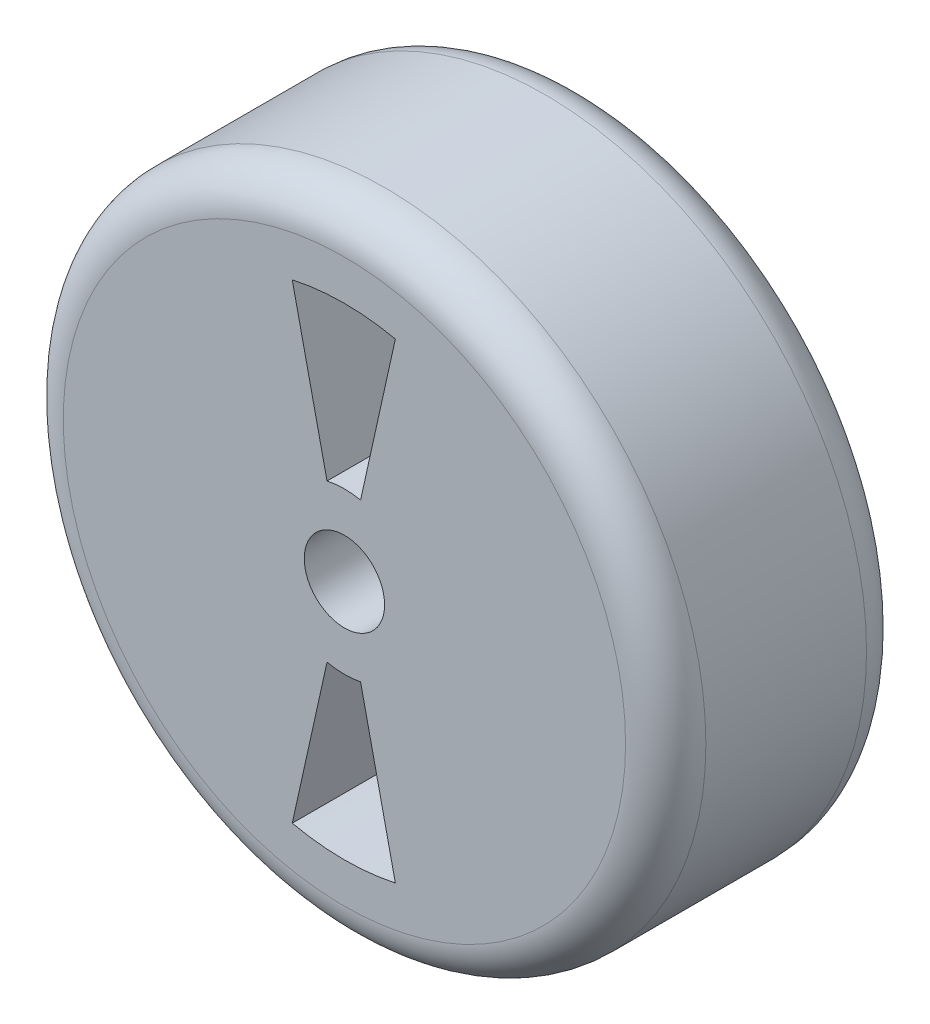
ISO-10303-21;
HEADER;
FILE_DESCRIPTION(('STEP AP214'),'2;1');
FILE_NAME('part.step','',(''),(''),'','','');
FILE_SCHEMA(('AUTOMOTIVE_DESIGN { 1 0 10303 214 1 1 1 1 }'));
ENDSEC;
DATA;
#1=APPLICATION_CONTEXT('core data for automotive mechanical design processes');
#2=APPLICATION_PROTOCOL_DEFINITION('international standard','automotive_design',2000,#1);
#3=PRODUCT_CONTEXT('',#1,'mechanical');
#4=PRODUCT('Part','Part','',(#3));
#5=PRODUCT_RELATED_PRODUCT_CATEGORY('part','',(#4));
#6=PRODUCT_DEFINITION_FORMATION('','',#4);
#7=PRODUCT_DEFINITION_CONTEXT('part definition',#1,'design');
#8=PRODUCT_DEFINITION('design','',#6,#7);
#9=PRODUCT_DEFINITION_SHAPE('','',#8);
#10=(LENGTH_UNIT() NAMED_UNIT(*) SI_UNIT(.MILLI.,.METRE.));
#11=(NAMED_UNIT(*) PLANE_ANGLE_UNIT() SI_UNIT($,.RADIAN.));
#12=(NAMED_UNIT(*) SI_UNIT($,.STERADIAN.) SOLID_ANGLE_UNIT());
#13=UNCERTAINTY_MEASURE_WITH_UNIT(LENGTH_MEASURE(1.E-05),#10,'distance_accuracy_value','');
#14=(GEOMETRIC_REPRESENTATION_CONTEXT(3) GLOBAL_UNCERTAINTY_ASSIGNED_CONTEXT((#13)) GLOBAL_UNIT_ASSIGNED_CONTEXT((#10,
#11,#12)) REPRESENTATION_CONTEXT('',''));
#15=CARTESIAN_POINT('',(0.,0.,0.));
#16=DIRECTION('',(0.,0.,1.));
#17=DIRECTION('',(1.,0.,0.));
#18=AXIS2_PLACEMENT_3D('',#15,#16,#17);
#19=CARTESIAN_POINT('',(0.,0.,-38.1));
#20=DIRECTION('',(0.,0.,1.));
#21=DIRECTION('',(1.,0.,0.));
#22=AXIS2_PLACEMENT_3D('',#19,#20,#21);
#23=PLANE('',#22);
#24=CARTESIAN_POINT('',(0.,0.,-38.1));
#25=DIRECTION('',(0.,0.,1.));
#26=DIRECTION('',(1.,0.,0.));
#27=AXIS2_PLACEMENT_3D('',#24,#25,#26);
#28=CIRCLE('',#27,12.7);
#29=CARTESIAN_POINT('',(12.7,0.,-38.1));
#30=VERTEX_POINT('',#29);
#31=EDGE_CURVE('E168',#30,#30,#28,.T.);
#32=ORIENTED_EDGE('',*,*,#31,.T.);
#33=EDGE_LOOP('',(#32));
#34=FACE_BOUND('',#33,.T.);
#35=CARTESIAN_POINT('',(0.,0.,-38.1));
#36=DIRECTION('',(0.,0.,1.));
#37=DIRECTION('',(1.,0.,0.));
#38=AXIS2_PLACEMENT_3D('',#35,#36,#37);
#39=CIRCLE('',#38,88.9);
#40=CARTESIAN_POINT('',(88.9,0.,-38.1));
#41=VERTEX_POINT('',#40);
#42=EDGE_CURVE('E11',#41,#41,#39,.F.);
#43=ORIENTED_EDGE('',*,*,#42,.T.);
#44=EDGE_LOOP('',(#43));
#45=FACE_BOUND('',#44,.T.);
#46=DIRECTION('',(0.216439613938104,-0.976296007119933,0.));
#47=VECTOR('',#46,1.);
#48=CARTESIAN_POINT('',(-5.49756619402784,24.7979185808463,-38.1));
#49=LINE('',#48,#47);
#50=CARTESIAN_POINT('',(-16.4944906129159,74.4018390712533,-38.1));
#51=VERTEX_POINT('',#50);
#52=CARTESIAN_POINT('',(-5.49756619402784,24.7979185808463,-38.1));
#53=VERTEX_POINT('',#52);
#54=EDGE_CURVE('E146',#51,#53,#49,.T.);
#55=ORIENTED_EDGE('',*,*,#54,.T.);
#56=CARTESIAN_POINT('',(0.,0.,-38.1));
#57=DIRECTION('',(0.,0.,-1.));
#58=DIRECTION('',(1.,0.,0.));
#59=AXIS2_PLACEMENT_3D('',#56,#57,#58);
#60=CIRCLE('',#59,25.4);
#61=CARTESIAN_POINT('',(5.11059947871828,24.8805500937605,-38.1));
#62=VERTEX_POINT('',#61);
#63=EDGE_CURVE('E136',#53,#62,#60,.T.);
#64=ORIENTED_EDGE('',*,*,#63,.T.);
#65=DIRECTION('',(0.216439613938103,0.976296007119933,0.));
#66=VECTOR('',#65,1.);
#67=CARTESIAN_POINT('',(5.11059947871828,24.8805500937605,-38.1));
#68=LINE('',#67,#66);
#69=CARTESIAN_POINT('',(16.1079686609387,74.486476781913,-38.1));
#70=VERTEX_POINT('',#69);
#71=EDGE_CURVE('E139',#62,#70,#68,.T.);
#72=ORIENTED_EDGE('',*,*,#71,.T.);
#73=CARTESIAN_POINT('',(0.,0.,-38.1));
#74=DIRECTION('',(0.,0.,1.));
#75=DIRECTION('',(1.,0.,0.));
#76=AXIS2_PLACEMENT_3D('',#73,#74,#75);
#77=CIRCLE('',#76,76.2082795880097);
#78=EDGE_CURVE('E143',#70,#51,#77,.T.);
#79=ORIENTED_EDGE('',*,*,#78,.T.);
#80=EDGE_LOOP('',(#55,#64,#72,#79));
#81=FACE_BOUND('',#80,.T.);
#82=CARTESIAN_POINT('',(0.,0.,-38.1));
#83=DIRECTION('',(0.,0.,1.));
#84=DIRECTION('',(1.,0.,0.));
#85=AXIS2_PLACEMENT_3D('',#82,#83,#84);
#86=CIRCLE('',#85,25.4);
#87=CARTESIAN_POINT('',(-5.49756619402784,-24.7979185808463,-38.1));
#88=VERTEX_POINT('',#87);
#89=CARTESIAN_POINT('',(5.11059947871828,-24.8805500937605,-38.1));
#90=VERTEX_POINT('',#89);
#91=EDGE_CURVE('E110',#88,#90,#86,.T.);
#92=ORIENTED_EDGE('',*,*,#91,.F.);
#93=DIRECTION('',(0.216439613938104,0.976296007119933,0.));
#94=VECTOR('',#93,1.);
#95=CARTESIAN_POINT('',(-5.49756619402784,-24.7979185808463,-38.1));
#96=LINE('',#95,#94);
#97=CARTESIAN_POINT('',(-16.4944906129159,-74.4018390712534,-38.1));
#98=VERTEX_POINT('',#97);
#99=EDGE_CURVE('E102',#98,#88,#96,.T.);
#100=ORIENTED_EDGE('',*,*,#99,.F.);
#101=CARTESIAN_POINT('',(0.,0.,-38.1));
#102=DIRECTION('',(0.,0.,-1.));
#103=DIRECTION('',(1.,0.,0.));
#104=AXIS2_PLACEMENT_3D('',#101,#102,#103);
#105=CIRCLE('',#104,76.2082795880097);
#106=CARTESIAN_POINT('',(16.1079686609387,-74.486476781913,-38.1));
#107=VERTEX_POINT('',#106);
#108=EDGE_CURVE('E109',#107,#98,#105,.T.);
#109=ORIENTED_EDGE('',*,*,#108,.F.);
#110=DIRECTION('',(0.216439613938103,-0.976296007119933,0.));
#111=VECTOR('',#110,1.);
#112=CARTESIAN_POINT('',(5.11059947871828,-24.8805500937605,-38.1));
#113=LINE('',#112,#111);
#114=EDGE_CURVE('E114',#90,#107,#113,.T.);
#115=ORIENTED_EDGE('',*,*,#114,.F.);
#116=EDGE_LOOP('',(#92,#100,#109,#115));
#117=FACE_BOUND('',#116,.T.);
#118=ADVANCED_FACE('F37',(#34,#45,#81,#117),#23,.F.);
#119=CARTESIAN_POINT('',(0.,0.,38.1));
#120=DIRECTION('',(0.,0.,1.));
#121=DIRECTION('',(1.,0.,0.));
#122=AXIS2_PLACEMENT_3D('',#119,#120,#121);
#123=PLANE('',#122);
#124=CARTESIAN_POINT('',(0.,0.,38.1));
#125=DIRECTION('',(0.,0.,-1.));
#126=DIRECTION('',(1.,0.,0.));
#127=AXIS2_PLACEMENT_3D('',#124,#125,#126);
#128=CIRCLE('',#127,25.4);
#129=CARTESIAN_POINT('',(-5.49756619402784,24.7979185808463,38.1));
#130=VERTEX_POINT('',#129);
#131=CARTESIAN_POINT('',(5.11059947871828,24.8805500937605,38.1));
#132=VERTEX_POINT('',#131);
#133=EDGE_CURVE('E132',#130,#132,#128,.T.);
#134=ORIENTED_EDGE('',*,*,#133,.F.);
#135=DIRECTION('',(0.216439613938104,-0.976296007119933,0.));
#136=VECTOR('',#135,1.);
#137=CARTESIAN_POINT('',(-5.49756619402784,24.7979185808463,38.1));
#138=LINE('',#137,#136);
#139=CARTESIAN_POINT('',(-16.4944906129159,74.4018390712533,38.1));
#140=VERTEX_POINT('',#139);
#141=EDGE_CURVE('E140',#140,#130,#138,.T.);
#142=ORIENTED_EDGE('',*,*,#141,.F.);
#143=CARTESIAN_POINT('',(0.,0.,38.1));
#144=DIRECTION('',(0.,0.,1.));
#145=DIRECTION('',(1.,0.,0.));
#146=AXIS2_PLACEMENT_3D('',#143,#144,#145);
#147=CIRCLE('',#146,76.2082795880097);
#148=CARTESIAN_POINT('',(16.1079686609387,74.486476781913,38.1));
#149=VERTEX_POINT('',#148);
#150=EDGE_CURVE('E154',#149,#140,#147,.T.);
#151=ORIENTED_EDGE('',*,*,#150,.F.);
#152=DIRECTION('',(0.216439613938103,0.976296007119933,0.));
#153=VECTOR('',#152,1.);
#154=CARTESIAN_POINT('',(5.11059947871828,24.8805500937605,38.1));
#155=LINE('',#154,#153);
#156=EDGE_CURVE('E151',#132,#149,#155,.T.);
#157=ORIENTED_EDGE('',*,*,#156,.F.);
#158=EDGE_LOOP('',(#134,#142,#151,#157));
#159=FACE_BOUND('',#158,.T.);
#160=CARTESIAN_POINT('',(0.,0.,38.1));
#161=DIRECTION('',(0.,0.,1.));
#162=DIRECTION('',(1.,0.,0.));
#163=AXIS2_PLACEMENT_3D('',#160,#161,#162);
#164=CIRCLE('',#163,88.9);
#165=CARTESIAN_POINT('',(88.9,0.,38.1));
#166=VERTEX_POINT('',#165);
#167=EDGE_CURVE('E171',#166,#166,#164,.T.);
#168=ORIENTED_EDGE('',*,*,#167,.T.);
#169=EDGE_LOOP('',(#168));
#170=FACE_BOUND('',#169,.T.);
#171=CARTESIAN_POINT('',(0.,0.,38.1));
#172=DIRECTION('',(0.,0.,1.));
#173=DIRECTION('',(1.,0.,0.));
#174=AXIS2_PLACEMENT_3D('',#171,#172,#173);
#175=CIRCLE('',#174,12.7);
#176=CARTESIAN_POINT('',(12.7,0.,38.1));
#177=VERTEX_POINT('',#176);
#178=EDGE_CURVE('E161',#177,#177,#175,.T.);
#179=ORIENTED_EDGE('',*,*,#178,.F.);
#180=EDGE_LOOP('',(#179));
#181=FACE_BOUND('',#180,.T.);
#182=DIRECTION('',(0.216439613938104,0.976296007119933,0.));
#183=VECTOR('',#182,1.);
#184=CARTESIAN_POINT('',(-5.49756619402784,-24.7979185808463,38.1));
#185=LINE('',#184,#183);
#186=CARTESIAN_POINT('',(-16.4944906129159,-74.4018390712533,38.1));
#187=VERTEX_POINT('',#186);
#188=CARTESIAN_POINT('',(-5.49756619402784,-24.7979185808463,38.1));
#189=VERTEX_POINT('',#188);
#190=EDGE_CURVE('E126',#187,#189,#185,.T.);
#191=ORIENTED_EDGE('',*,*,#190,.T.);
#192=CARTESIAN_POINT('',(0.,0.,38.1));
#193=DIRECTION('',(0.,0.,1.));
#194=DIRECTION('',(1.,0.,0.));
#195=AXIS2_PLACEMENT_3D('',#192,#193,#194);
#196=CIRCLE('',#195,25.4);
#197=CARTESIAN_POINT('',(5.11059947871828,-24.8805500937605,38.1));
#198=VERTEX_POINT('',#197);
#199=EDGE_CURVE('E60',#189,#198,#196,.T.);
#200=ORIENTED_EDGE('',*,*,#199,.T.);
#201=DIRECTION('',(0.216439613938103,-0.976296007119933,0.));
#202=VECTOR('',#201,1.);
#203=CARTESIAN_POINT('',(5.11059947871828,-24.8805500937605,38.1));
#204=LINE('',#203,#202);
#205=CARTESIAN_POINT('',(16.1079686609387,-74.486476781913,38.1));
#206=VERTEX_POINT('',#205);
#207=EDGE_CURVE('E117',#198,#206,#204,.T.);
#208=ORIENTED_EDGE('',*,*,#207,.T.);
#209=CARTESIAN_POINT('',(0.,0.,38.1));
#210=DIRECTION('',(0.,0.,-1.));
#211=DIRECTION('',(1.,0.,0.));
#212=AXIS2_PLACEMENT_3D('',#209,#210,#211);
#213=CIRCLE('',#212,76.2082795880097);
#214=EDGE_CURVE('E120',#206,#187,#213,.T.);
#215=ORIENTED_EDGE('',*,*,#214,.T.);
#216=EDGE_LOOP('',(#191,#200,#208,#215));
#217=FACE_BOUND('',#216,.T.);
#218=ADVANCED_FACE('F199',(#159,#170,#181,#217),#123,.T.);
#219=CARTESIAN_POINT('',(0.,0.,-38.1));
#220=DIRECTION('',(0.,0.,1.));
#221=DIRECTION('',(1.,0.,0.));
#222=AXIS2_PLACEMENT_3D('',#219,#220,#221);
#223=CYLINDRICAL_SURFACE('',#222,101.6);
#224=CARTESIAN_POINT('',(0.,0.,-25.4));
#225=DIRECTION('',(0.,0.,1.));
#226=DIRECTION('',(1.,0.,0.));
#227=AXIS2_PLACEMENT_3D('',#224,#225,#226);
#228=CIRCLE('',#227,101.6);
#229=CARTESIAN_POINT('',(101.6,0.,-25.4));
#230=VERTEX_POINT('',#229);
#231=EDGE_CURVE('E45',#230,#230,#228,.T.);
#232=ORIENTED_EDGE('',*,*,#231,.T.);
#233=EDGE_LOOP('',(#232));
#234=FACE_BOUND('',#233,.T.);
#235=CARTESIAN_POINT('',(0.,0.,25.4));
#236=DIRECTION('',(0.,0.,1.));
#237=DIRECTION('',(1.,0.,0.));
#238=AXIS2_PLACEMENT_3D('',#235,#236,#237);
#239=CIRCLE('',#238,101.6);
#240=CARTESIAN_POINT('',(101.6,0.,25.4));
#241=VERTEX_POINT('',#240);
#242=EDGE_CURVE('E176',#241,#241,#239,.F.);
#243=ORIENTED_EDGE('',*,*,#242,.T.);
#244=EDGE_LOOP('',(#243));
#245=FACE_BOUND('',#244,.T.);
#246=ADVANCED_FACE('F181',(#234,#245),#223,.T.);
#247=CARTESIAN_POINT('',(0.,0.,-38.1));
#248=DIRECTION('',(0.,0.,1.));
#249=DIRECTION('',(1.,0.,0.));
#250=AXIS2_PLACEMENT_3D('',#247,#248,#249);
#251=CYLINDRICAL_SURFACE('',#250,12.7);
#252=ORIENTED_EDGE('',*,*,#31,.F.);
#253=EDGE_LOOP('',(#252));
#254=FACE_BOUND('',#253,.T.);
#255=ORIENTED_EDGE('',*,*,#178,.T.);
#256=EDGE_LOOP('',(#255));
#257=FACE_BOUND('',#256,.T.);
#258=ADVANCED_FACE('F195',(#254,#257),#251,.F.);
#259=CARTESIAN_POINT('',(0.,0.,25.4));
#260=DIRECTION('',(0.,0.,1.));
#261=DIRECTION('',(1.,0.,0.));
#262=AXIS2_PLACEMENT_3D('',#259,#260,#261);
#263=TOROIDAL_SURFACE('',#262,88.9,12.7);
#264=ORIENTED_EDGE('',*,*,#242,.F.);
#265=EDGE_LOOP('',(#264));
#266=FACE_BOUND('',#265,.T.);
#267=ORIENTED_EDGE('',*,*,#167,.F.);
#268=EDGE_LOOP('',(#267));
#269=FACE_BOUND('',#268,.T.);
#270=ADVANCED_FACE('F186',(#266,#269),#263,.T.);
#271=CARTESIAN_POINT('',(0.,0.,-25.4));
#272=DIRECTION('',(0.,0.,1.));
#273=DIRECTION('',(1.,0.,0.));
#274=AXIS2_PLACEMENT_3D('',#271,#272,#273);
#275=TOROIDAL_SURFACE('',#274,88.9,12.7);
#276=ORIENTED_EDGE('',*,*,#42,.F.);
#277=EDGE_LOOP('',(#276));
#278=FACE_BOUND('',#277,.T.);
#279=ORIENTED_EDGE('',*,*,#231,.F.);
#280=EDGE_LOOP('',(#279));
#281=FACE_BOUND('',#280,.T.);
#282=ADVANCED_FACE('F39',(#278,#281),#275,.T.);
#283=CARTESIAN_POINT('',(0.,0.,-38.1));
#284=DIRECTION('',(0.,0.,1.));
#285=DIRECTION('',(1.,0.,0.));
#286=AXIS2_PLACEMENT_3D('',#283,#284,#285);
#287=CYLINDRICAL_SURFACE('',#286,25.4);
#288=ORIENTED_EDGE('',*,*,#133,.T.);
#289=DIRECTION('',(0.,0.,1.));
#290=VECTOR('',#289,1.);
#291=CARTESIAN_POINT('',(5.11059947871828,24.8805500937605,-38.1));
#292=LINE('',#291,#290);
#293=EDGE_CURVE('E149',#62,#132,#292,.T.);
#294=ORIENTED_EDGE('',*,*,#293,.F.);
#295=ORIENTED_EDGE('',*,*,#63,.F.);
#296=DIRECTION('',(0.,0.,1.));
#297=VECTOR('',#296,1.);
#298=CARTESIAN_POINT('',(-5.49756619402784,24.7979185808463,-38.1));
#299=LINE('',#298,#297);
#300=EDGE_CURVE('E159',#53,#130,#299,.T.);
#301=ORIENTED_EDGE('',*,*,#300,.T.);
#302=EDGE_LOOP('',(#288,#294,#295,#301));
#303=FACE_BOUND('',#302,.T.);
#304=ADVANCED_FACE('F185',(#303),#287,.T.);
#305=CARTESIAN_POINT('',(-5.49756619402784,24.7979185808463,-38.1));
#306=DIRECTION('',(-0.976296007119933,-0.216439613938104,0.));
#307=DIRECTION('',(0.216439613938104,-0.976296007119933,0.));
#308=AXIS2_PLACEMENT_3D('',#305,#306,#307);
#309=PLANE('',#308);
#310=ORIENTED_EDGE('',*,*,#141,.T.);
#311=ORIENTED_EDGE('',*,*,#300,.F.);
#312=ORIENTED_EDGE('',*,*,#54,.F.);
#313=DIRECTION('',(0.,0.,1.));
#314=VECTOR('',#313,1.);
#315=CARTESIAN_POINT('',(-16.4944906129159,74.4018390712533,-38.1));
#316=LINE('',#315,#314);
#317=EDGE_CURVE('E162',#51,#140,#316,.T.);
#318=ORIENTED_EDGE('',*,*,#317,.T.);
#319=EDGE_LOOP('',(#310,#311,#312,#318));
#320=FACE_BOUND('',#319,.T.);
#321=ADVANCED_FACE('F192',(#320),#309,.F.);
#322=CARTESIAN_POINT('',(0.,0.,-38.1));
#323=DIRECTION('',(0.,0.,1.));
#324=DIRECTION('',(1.,0.,0.));
#325=AXIS2_PLACEMENT_3D('',#322,#323,#324);
#326=CYLINDRICAL_SURFACE('',#325,76.2082795880097);
#327=ORIENTED_EDGE('',*,*,#150,.T.);
#328=ORIENTED_EDGE('',*,*,#317,.F.);
#329=ORIENTED_EDGE('',*,*,#78,.F.);
#330=DIRECTION('',(0.,0.,1.));
#331=VECTOR('',#330,1.);
#332=CARTESIAN_POINT('',(16.1079686609387,74.486476781913,-38.1));
#333=LINE('',#332,#331);
#334=EDGE_CURVE('E164',#70,#149,#333,.T.);
#335=ORIENTED_EDGE('',*,*,#334,.T.);
#336=EDGE_LOOP('',(#327,#328,#329,#335));
#337=FACE_BOUND('',#336,.T.);
#338=ADVANCED_FACE('F223',(#337),#326,.F.);
#339=CARTESIAN_POINT('',(5.11059947871828,24.8805500937605,-38.1));
#340=DIRECTION('',(0.976296007119933,-0.216439613938103,0.));
#341=DIRECTION('',(0.216439613938103,0.976296007119933,0.));
#342=AXIS2_PLACEMENT_3D('',#339,#340,#341);
#343=PLANE('',#342);
#344=ORIENTED_EDGE('',*,*,#156,.T.);
#345=ORIENTED_EDGE('',*,*,#334,.F.);
#346=ORIENTED_EDGE('',*,*,#71,.F.);
#347=ORIENTED_EDGE('',*,*,#293,.T.);
#348=EDGE_LOOP('',(#344,#345,#346,#347));
#349=FACE_BOUND('',#348,.T.);
#350=ADVANCED_FACE('F220',(#349),#343,.F.);
#351=CARTESIAN_POINT('',(0.,0.,-38.1));
#352=DIRECTION('',(0.,0.,1.));
#353=DIRECTION('',(1.,0.,0.));
#354=AXIS2_PLACEMENT_3D('',#351,#352,#353);
#355=CYLINDRICAL_SURFACE('',#354,25.4);
#356=ORIENTED_EDGE('',*,*,#199,.F.);
#357=DIRECTION('',(0.,0.,1.));
#358=VECTOR('',#357,1.);
#359=CARTESIAN_POINT('',(-5.49756619402784,-24.7979185808463,-38.1));
#360=LINE('',#359,#358);
#361=EDGE_CURVE('E104',#88,#189,#360,.T.);
#362=ORIENTED_EDGE('',*,*,#361,.F.);
#363=ORIENTED_EDGE('',*,*,#91,.T.);
#364=DIRECTION('',(0.,0.,1.));
#365=VECTOR('',#364,1.);
#366=CARTESIAN_POINT('',(5.11059947871828,-24.8805500937605,-38.1));
#367=LINE('',#366,#365);
#368=EDGE_CURVE('E130',#90,#198,#367,.T.);
#369=ORIENTED_EDGE('',*,*,#368,.T.);
#370=EDGE_LOOP('',(#356,#362,#363,#369));
#371=FACE_BOUND('',#370,.T.);
#372=ADVANCED_FACE('F112',(#371),#355,.T.);
#373=CARTESIAN_POINT('',(5.11059947871828,-24.8805500937605,-38.1));
#374=DIRECTION('',(-0.976296007119933,-0.216439613938103,0.));
#375=DIRECTION('',(0.216439613938103,-0.976296007119933,0.));
#376=AXIS2_PLACEMENT_3D('',#373,#374,#375);
#377=PLANE('',#376);
#378=ORIENTED_EDGE('',*,*,#207,.F.);
#379=ORIENTED_EDGE('',*,*,#368,.F.);
#380=ORIENTED_EDGE('',*,*,#114,.T.);
#381=DIRECTION('',(0.,0.,1.));
#382=VECTOR('',#381,1.);
#383=CARTESIAN_POINT('',(16.1079686609387,-74.486476781913,-38.1));
#384=LINE('',#383,#382);
#385=EDGE_CURVE('E133',#107,#206,#384,.T.);
#386=ORIENTED_EDGE('',*,*,#385,.T.);
#387=EDGE_LOOP('',(#378,#379,#380,#386));
#388=FACE_BOUND('',#387,.T.);
#389=ADVANCED_FACE('F233',(#388),#377,.T.);
#390=CARTESIAN_POINT('',(0.,0.,-38.1));
#391=DIRECTION('',(0.,0.,1.));
#392=DIRECTION('',(1.,0.,0.));
#393=AXIS2_PLACEMENT_3D('',#390,#391,#392);
#394=CYLINDRICAL_SURFACE('',#393,76.2082795880097);
#395=ORIENTED_EDGE('',*,*,#214,.F.);
#396=ORIENTED_EDGE('',*,*,#385,.F.);
#397=ORIENTED_EDGE('',*,*,#108,.T.);
#398=DIRECTION('',(0.,0.,1.));
#399=VECTOR('',#398,1.);
#400=CARTESIAN_POINT('',(-16.4944906129159,-74.4018390712533,-38.1));
#401=LINE('',#400,#399);
#402=EDGE_CURVE('E52',#98,#187,#401,.T.);
#403=ORIENTED_EDGE('',*,*,#402,.T.);
#404=EDGE_LOOP('',(#395,#396,#397,#403));
#405=FACE_BOUND('',#404,.T.);
#406=ADVANCED_FACE('F236',(#405),#394,.F.);
#407=CARTESIAN_POINT('',(-5.49756619402784,-24.7979185808463,-38.1));
#408=DIRECTION('',(0.976296007119933,-0.216439613938104,0.));
#409=DIRECTION('',(0.216439613938104,0.976296007119933,0.));
#410=AXIS2_PLACEMENT_3D('',#407,#408,#409);
#411=PLANE('',#410);
#412=ORIENTED_EDGE('',*,*,#190,.F.);
#413=ORIENTED_EDGE('',*,*,#402,.F.);
#414=ORIENTED_EDGE('',*,*,#99,.T.);
#415=ORIENTED_EDGE('',*,*,#361,.T.);
#416=EDGE_LOOP('',(#412,#413,#414,#415));
#417=FACE_BOUND('',#416,.T.);
#418=ADVANCED_FACE('F103',(#417),#411,.T.);
#419=CLOSED_SHELL('',(#118,#218,#246,#258,#270,#282,#304,#321,#338,#350,#372,#389,#406,#418));
#420=MANIFOLD_SOLID_BREP('B2',#419);
#421=ADVANCED_BREP_SHAPE_REPRESENTATION('',(#18,#420),#14);
#422=SHAPE_DEFINITION_REPRESENTATION(#9,#421);
ENDSEC;
END-ISO-10303-21;
